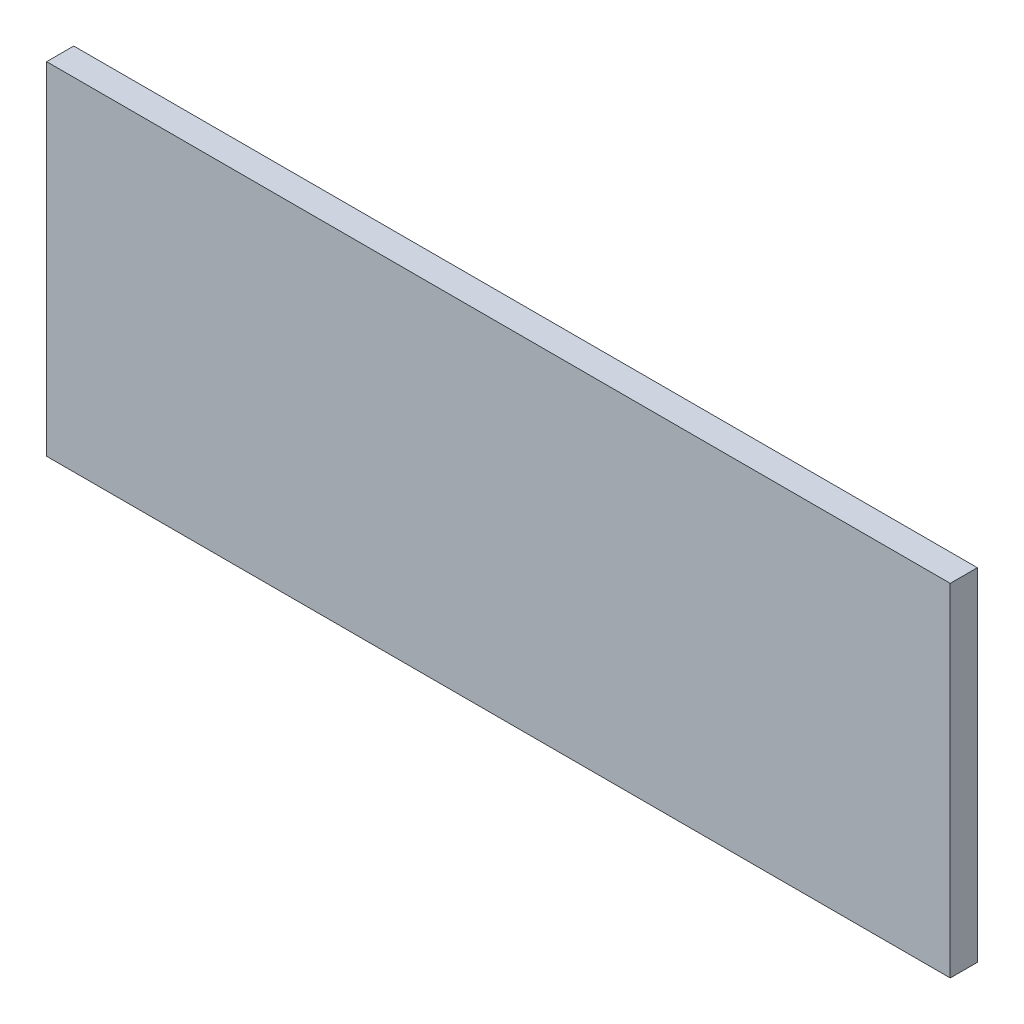
ISO-10303-21;
HEADER;
FILE_DESCRIPTION(('STEP AP214'),'2;1');
FILE_NAME('part.step','',(''),(''),'','','');
FILE_SCHEMA(('AUTOMOTIVE_DESIGN { 1 0 10303 214 1 1 1 1 }'));
ENDSEC;
DATA;
#1=APPLICATION_CONTEXT('core data for automotive mechanical design processes');
#2=APPLICATION_PROTOCOL_DEFINITION('international standard','automotive_design',2000,#1);
#3=PRODUCT_CONTEXT('',#1,'mechanical');
#4=PRODUCT('Part','Part','',(#3));
#5=PRODUCT_RELATED_PRODUCT_CATEGORY('part','',(#4));
#6=PRODUCT_DEFINITION_FORMATION('','',#4);
#7=PRODUCT_DEFINITION_CONTEXT('part definition',#1,'design');
#8=PRODUCT_DEFINITION('design','',#6,#7);
#9=PRODUCT_DEFINITION_SHAPE('','',#8);
#10=(LENGTH_UNIT() NAMED_UNIT(*) SI_UNIT(.MILLI.,.METRE.));
#11=(NAMED_UNIT(*) PLANE_ANGLE_UNIT() SI_UNIT($,.RADIAN.));
#12=(NAMED_UNIT(*) SI_UNIT($,.STERADIAN.) SOLID_ANGLE_UNIT());
#13=UNCERTAINTY_MEASURE_WITH_UNIT(LENGTH_MEASURE(1.E-05),#10,'distance_accuracy_value','');
#14=(GEOMETRIC_REPRESENTATION_CONTEXT(3) GLOBAL_UNCERTAINTY_ASSIGNED_CONTEXT((#13)) GLOBAL_UNIT_ASSIGNED_CONTEXT((#10,
#11,#12)) REPRESENTATION_CONTEXT('',''));
#15=CARTESIAN_POINT('',(0.,0.,0.));
#16=DIRECTION('',(0.,0.,1.));
#17=DIRECTION('',(1.,0.,0.));
#18=AXIS2_PLACEMENT_3D('',#15,#16,#17);
#19=CARTESIAN_POINT('',(-557.5,210.87,33.45));
#20=DIRECTION('',(1.,0.,0.));
#21=DIRECTION('',(0.,0.,-1.));
#22=AXIS2_PLACEMENT_3D('',#19,#20,#21);
#23=PLANE('',#22);
#24=DIRECTION('',(0.,-1.,0.));
#25=VECTOR('',#24,1.);
#26=CARTESIAN_POINT('',(-557.5,210.87,0.));
#27=LINE('',#26,#25);
#28=CARTESIAN_POINT('',(-557.5,210.87,0.));
#29=VERTEX_POINT('',#28);
#30=CARTESIAN_POINT('',(-557.5,-210.87,0.));
#31=VERTEX_POINT('',#30);
#32=EDGE_CURVE('E113',#29,#31,#27,.T.);
#33=ORIENTED_EDGE('',*,*,#32,.T.);
#34=DIRECTION('',(0.,0.,-1.));
#35=VECTOR('',#34,1.);
#36=CARTESIAN_POINT('',(-557.5,-210.87,33.45));
#37=LINE('',#36,#35);
#38=CARTESIAN_POINT('',(-557.5,-210.87,33.45));
#39=VERTEX_POINT('',#38);
#40=EDGE_CURVE('E11',#39,#31,#37,.T.);
#41=ORIENTED_EDGE('',*,*,#40,.F.);
#42=DIRECTION('',(0.,-1.,0.));
#43=VECTOR('',#42,1.);
#44=CARTESIAN_POINT('',(-557.5,210.87,33.45));
#45=LINE('',#44,#43);
#46=CARTESIAN_POINT('',(-557.5,210.87,33.45));
#47=VERTEX_POINT('',#46);
#48=EDGE_CURVE('E97',#47,#39,#45,.T.);
#49=ORIENTED_EDGE('',*,*,#48,.F.);
#50=DIRECTION('',(0.,0.,-1.));
#51=VECTOR('',#50,1.);
#52=CARTESIAN_POINT('',(-557.5,210.87,33.45));
#53=LINE('',#52,#51);
#54=EDGE_CURVE('E109',#47,#29,#53,.T.);
#55=ORIENTED_EDGE('',*,*,#54,.T.);
#56=EDGE_LOOP('',(#33,#41,#49,#55));
#57=FACE_BOUND('',#56,.T.);
#58=ADVANCED_FACE('F45',(#57),#23,.F.);
#59=CARTESIAN_POINT('',(557.5,-210.87,33.45));
#60=DIRECTION('',(0.,1.,0.));
#61=DIRECTION('',(-1.,0.,0.));
#62=AXIS2_PLACEMENT_3D('',#59,#60,#61);
#63=PLANE('',#62);
#64=DIRECTION('',(1.,0.,0.));
#65=VECTOR('',#64,1.);
#66=CARTESIAN_POINT('',(557.5,-210.87,0.));
#67=LINE('',#66,#65);
#68=CARTESIAN_POINT('',(557.5,-210.87,0.));
#69=VERTEX_POINT('',#68);
#70=EDGE_CURVE('E102',#31,#69,#67,.T.);
#71=ORIENTED_EDGE('',*,*,#70,.T.);
#72=DIRECTION('',(0.,0.,-1.));
#73=VECTOR('',#72,1.);
#74=CARTESIAN_POINT('',(557.5,-210.87,33.45));
#75=LINE('',#74,#73);
#76=CARTESIAN_POINT('',(557.5,-210.87,33.45));
#77=VERTEX_POINT('',#76);
#78=EDGE_CURVE('E54',#77,#69,#75,.T.);
#79=ORIENTED_EDGE('',*,*,#78,.F.);
#80=DIRECTION('',(1.,0.,0.));
#81=VECTOR('',#80,1.);
#82=CARTESIAN_POINT('',(557.5,-210.87,33.45));
#83=LINE('',#82,#81);
#84=EDGE_CURVE('E92',#39,#77,#83,.T.);
#85=ORIENTED_EDGE('',*,*,#84,.F.);
#86=ORIENTED_EDGE('',*,*,#40,.T.);
#87=EDGE_LOOP('',(#71,#79,#85,#86));
#88=FACE_BOUND('',#87,.T.);
#89=ADVANCED_FACE('F101',(#88),#63,.F.);
#90=CARTESIAN_POINT('',(557.5,210.87,33.45));
#91=DIRECTION('',(-1.,0.,0.));
#92=DIRECTION('',(0.,0.,1.));
#93=AXIS2_PLACEMENT_3D('',#90,#91,#92);
#94=PLANE('',#93);
#95=DIRECTION('',(0.,1.,0.));
#96=VECTOR('',#95,1.);
#97=CARTESIAN_POINT('',(557.5,210.87,0.));
#98=LINE('',#97,#96);
#99=CARTESIAN_POINT('',(557.5,210.87,0.));
#100=VERTEX_POINT('',#99);
#101=EDGE_CURVE('E79',#69,#100,#98,.T.);
#102=ORIENTED_EDGE('',*,*,#101,.T.);
#103=DIRECTION('',(0.,0.,-1.));
#104=VECTOR('',#103,1.);
#105=CARTESIAN_POINT('',(557.5,210.87,33.45));
#106=LINE('',#105,#104);
#107=CARTESIAN_POINT('',(557.5,210.87,33.45));
#108=VERTEX_POINT('',#107);
#109=EDGE_CURVE('E104',#108,#100,#106,.T.);
#110=ORIENTED_EDGE('',*,*,#109,.F.);
#111=DIRECTION('',(0.,1.,0.));
#112=VECTOR('',#111,1.);
#113=CARTESIAN_POINT('',(557.5,210.87,33.45));
#114=LINE('',#113,#112);
#115=EDGE_CURVE('E95',#77,#108,#114,.T.);
#116=ORIENTED_EDGE('',*,*,#115,.F.);
#117=ORIENTED_EDGE('',*,*,#78,.T.);
#118=EDGE_LOOP('',(#102,#110,#116,#117));
#119=FACE_BOUND('',#118,.T.);
#120=ADVANCED_FACE('F105',(#119),#94,.F.);
#121=CARTESIAN_POINT('',(557.5,210.87,33.45));
#122=DIRECTION('',(0.,-1.,0.));
#123=DIRECTION('',(1.,0.,0.));
#124=AXIS2_PLACEMENT_3D('',#121,#122,#123);
#125=PLANE('',#124);
#126=DIRECTION('',(-1.,0.,0.));
#127=VECTOR('',#126,1.);
#128=CARTESIAN_POINT('',(557.5,210.87,0.));
#129=LINE('',#128,#127);
#130=EDGE_CURVE('E85',#100,#29,#129,.T.);
#131=ORIENTED_EDGE('',*,*,#130,.T.);
#132=ORIENTED_EDGE('',*,*,#54,.F.);
#133=DIRECTION('',(-1.,0.,0.));
#134=VECTOR('',#133,1.);
#135=CARTESIAN_POINT('',(557.5,210.87,33.45));
#136=LINE('',#135,#134);
#137=EDGE_CURVE('E62',#108,#47,#136,.T.);
#138=ORIENTED_EDGE('',*,*,#137,.F.);
#139=ORIENTED_EDGE('',*,*,#109,.T.);
#140=EDGE_LOOP('',(#131,#132,#138,#139));
#141=FACE_BOUND('',#140,.T.);
#142=ADVANCED_FACE('F126',(#141),#125,.F.);
#143=CARTESIAN_POINT('',(0.,0.,33.45));
#144=DIRECTION('',(0.,0.,-1.));
#145=DIRECTION('',(-1.,0.,0.));
#146=AXIS2_PLACEMENT_3D('',#143,#144,#145);
#147=PLANE('',#146);
#148=ORIENTED_EDGE('',*,*,#48,.T.);
#149=ORIENTED_EDGE('',*,*,#84,.T.);
#150=ORIENTED_EDGE('',*,*,#115,.T.);
#151=ORIENTED_EDGE('',*,*,#137,.T.);
#152=EDGE_LOOP('',(#148,#149,#150,#151));
#153=FACE_BOUND('',#152,.T.);
#154=ADVANCED_FACE('F93',(#153),#147,.F.);
#155=CARTESIAN_POINT('',(0.,0.,0.));
#156=DIRECTION('',(0.,0.,-1.));
#157=DIRECTION('',(-1.,0.,0.));
#158=AXIS2_PLACEMENT_3D('',#155,#156,#157);
#159=PLANE('',#158);
#160=ORIENTED_EDGE('',*,*,#32,.F.);
#161=ORIENTED_EDGE('',*,*,#130,.F.);
#162=ORIENTED_EDGE('',*,*,#101,.F.);
#163=ORIENTED_EDGE('',*,*,#70,.F.);
#164=EDGE_LOOP('',(#160,#161,#162,#163));
#165=FACE_BOUND('',#164,.T.);
#166=ADVANCED_FACE('F129',(#165),#159,.T.);
#167=CLOSED_SHELL('',(#58,#89,#120,#142,#154,#166));
#168=MANIFOLD_SOLID_BREP('B2',#167);
#169=ADVANCED_BREP_SHAPE_REPRESENTATION('',(#18,#168),#14);
#170=SHAPE_DEFINITION_REPRESENTATION(#9,#169);
ENDSEC;
END-ISO-10303-21;
